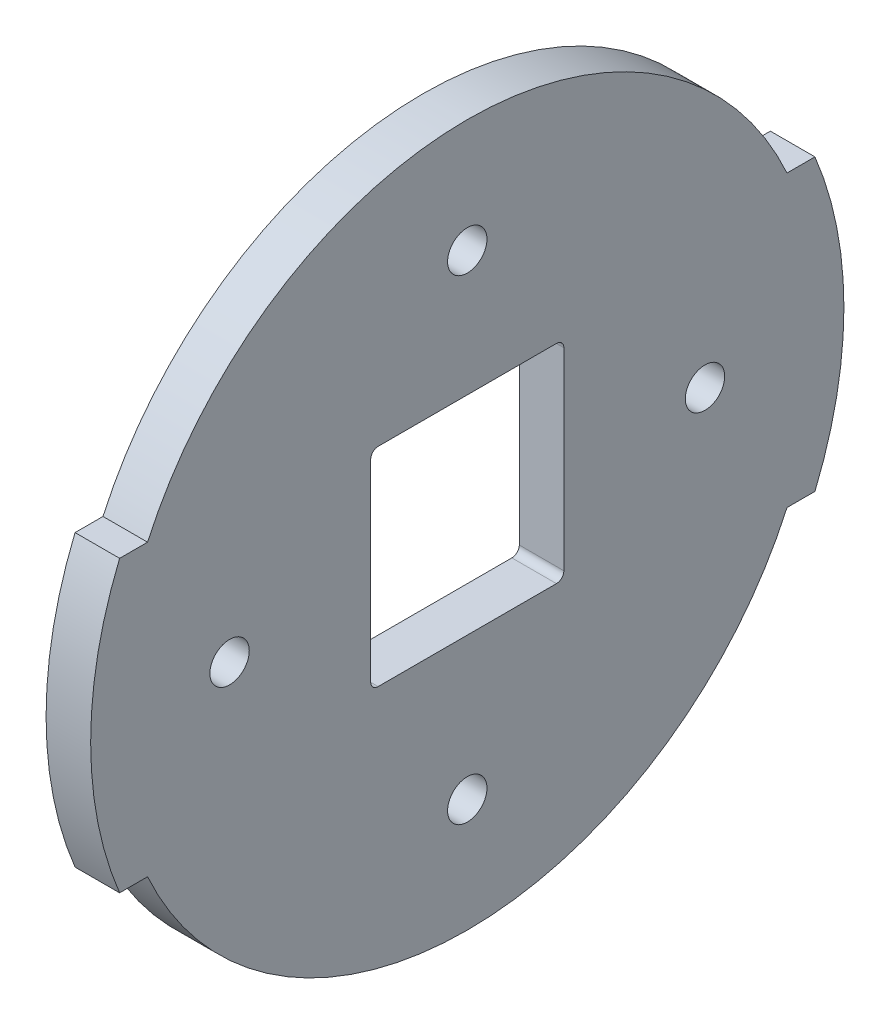
ISO-10303-21;
HEADER;
FILE_DESCRIPTION(('STEP AP214'),'2;1');
FILE_NAME('part.step','',(''),(''),'','','');
FILE_SCHEMA(('AUTOMOTIVE_DESIGN { 1 0 10303 214 1 1 1 1 }'));
ENDSEC;
DATA;
#1=APPLICATION_CONTEXT('core data for automotive mechanical design processes');
#2=APPLICATION_PROTOCOL_DEFINITION('international standard','automotive_design',2000,#1);
#3=PRODUCT_CONTEXT('',#1,'mechanical');
#4=PRODUCT('Part','Part','',(#3));
#5=PRODUCT_RELATED_PRODUCT_CATEGORY('part','',(#4));
#6=PRODUCT_DEFINITION_FORMATION('','',#4);
#7=PRODUCT_DEFINITION_CONTEXT('part definition',#1,'design');
#8=PRODUCT_DEFINITION('design','',#6,#7);
#9=PRODUCT_DEFINITION_SHAPE('','',#8);
#10=(LENGTH_UNIT() NAMED_UNIT(*) SI_UNIT(.MILLI.,.METRE.));
#11=(NAMED_UNIT(*) PLANE_ANGLE_UNIT() SI_UNIT($,.RADIAN.));
#12=(NAMED_UNIT(*) SI_UNIT($,.STERADIAN.) SOLID_ANGLE_UNIT());
#13=UNCERTAINTY_MEASURE_WITH_UNIT(LENGTH_MEASURE(1.E-05),#10,'distance_accuracy_value','');
#14=(GEOMETRIC_REPRESENTATION_CONTEXT(3) GLOBAL_UNCERTAINTY_ASSIGNED_CONTEXT((#13)) GLOBAL_UNIT_ASSIGNED_CONTEXT((#10,
#11,#12)) REPRESENTATION_CONTEXT('',''));
#15=CARTESIAN_POINT('',(0.,0.,0.));
#16=DIRECTION('',(0.,0.,1.));
#17=DIRECTION('',(1.,0.,0.));
#18=AXIS2_PLACEMENT_3D('',#15,#16,#17);
#19=CARTESIAN_POINT('',(6.,0.,0.));
#20=DIRECTION('',(1.,0.,0.));
#21=DIRECTION('',(0.,0.,-1.));
#22=AXIS2_PLACEMENT_3D('',#19,#20,#21);
#23=PLANE('',#22);
#24=CARTESIAN_POINT('',(6.,0.,-32.));
#25=DIRECTION('',(1.,0.,0.));
#26=DIRECTION('',(0.,0.,-1.));
#27=AXIS2_PLACEMENT_3D('',#24,#25,#26);
#28=CIRCLE('',#27,2.64999999999999);
#29=CARTESIAN_POINT('',(6.,0.,-34.65));
#30=VERTEX_POINT('',#29);
#31=EDGE_CURVE('E306',#30,#30,#28,.T.);
#32=ORIENTED_EDGE('',*,*,#31,.F.);
#33=EDGE_LOOP('',(#32));
#34=FACE_BOUND('',#33,.T.);
#35=CARTESIAN_POINT('',(6.,32.,1.1172740284298E-13));
#36=DIRECTION('',(1.,0.,0.));
#37=DIRECTION('',(0.,0.,-1.));
#38=AXIS2_PLACEMENT_3D('',#35,#36,#37);
#39=CIRCLE('',#38,2.64999999999999);
#40=CARTESIAN_POINT('',(6.,32.,-2.64999999999987));
#41=VERTEX_POINT('',#40);
#42=EDGE_CURVE('E300',#41,#41,#39,.T.);
#43=ORIENTED_EDGE('',*,*,#42,.F.);
#44=EDGE_LOOP('',(#43));
#45=FACE_BOUND('',#44,.T.);
#46=CARTESIAN_POINT('',(6.,-2.23454805685961E-13,32.));
#47=DIRECTION('',(1.,0.,0.));
#48=DIRECTION('',(0.,0.,-1.));
#49=AXIS2_PLACEMENT_3D('',#46,#47,#48);
#50=CIRCLE('',#49,2.64999999999999);
#51=CARTESIAN_POINT('',(6.,-2.23454805685961E-13,29.35));
#52=VERTEX_POINT('',#51);
#53=EDGE_CURVE('E294',#52,#52,#50,.T.);
#54=ORIENTED_EDGE('',*,*,#53,.F.);
#55=EDGE_LOOP('',(#54));
#56=FACE_BOUND('',#55,.T.);
#57=CARTESIAN_POINT('',(6.,-32.,-3.35182208528941E-13));
#58=DIRECTION('',(1.,0.,0.));
#59=DIRECTION('',(0.,0.,-1.));
#60=AXIS2_PLACEMENT_3D('',#57,#58,#59);
#61=CIRCLE('',#60,2.64999999999999);
#62=CARTESIAN_POINT('',(6.,-32.,-2.65000000000032));
#63=VERTEX_POINT('',#62);
#64=EDGE_CURVE('E287',#63,#63,#61,.T.);
#65=ORIENTED_EDGE('',*,*,#64,.F.);
#66=EDGE_LOOP('',(#65));
#67=FACE_BOUND('',#66,.T.);
#68=CARTESIAN_POINT('',(6.,0.,0.));
#69=DIRECTION('',(1.,0.,0.));
#70=DIRECTION('',(0.,0.,-1.));
#71=AXIS2_PLACEMENT_3D('',#68,#69,#70);
#72=CIRCLE('',#71,50.7);
#73=CARTESIAN_POINT('',(6.,19.5,46.8));
#74=VERTEX_POINT('',#73);
#75=CARTESIAN_POINT('',(6.,-19.5,46.8));
#76=VERTEX_POINT('',#75);
#77=EDGE_CURVE('E196',#74,#76,#72,.T.);
#78=ORIENTED_EDGE('',*,*,#77,.T.);
#79=DIRECTION('',(0.,0.,-1.));
#80=VECTOR('',#79,1.);
#81=CARTESIAN_POINT('',(6.,-19.5,46.8));
#82=LINE('',#81,#80);
#83=CARTESIAN_POINT('',(6.,-19.5,43.0385002062107));
#84=VERTEX_POINT('',#83);
#85=EDGE_CURVE('E199',#76,#84,#82,.T.);
#86=ORIENTED_EDGE('',*,*,#85,.T.);
#87=CARTESIAN_POINT('',(6.,0.,0.));
#88=DIRECTION('',(1.,0.,0.));
#89=DIRECTION('',(0.,0.,-1.));
#90=AXIS2_PLACEMENT_3D('',#87,#88,#89);
#91=CIRCLE('',#90,47.25);
#92=CARTESIAN_POINT('',(6.,-19.5,-43.0385002062107));
#93=VERTEX_POINT('',#92);
#94=EDGE_CURVE('E202',#84,#93,#91,.T.);
#95=ORIENTED_EDGE('',*,*,#94,.T.);
#96=DIRECTION('',(0.,0.,-1.));
#97=VECTOR('',#96,1.);
#98=CARTESIAN_POINT('',(6.,-19.5,-46.8));
#99=LINE('',#98,#97);
#100=CARTESIAN_POINT('',(6.,-19.5,-46.8));
#101=VERTEX_POINT('',#100);
#102=EDGE_CURVE('E204',#93,#101,#99,.T.);
#103=ORIENTED_EDGE('',*,*,#102,.T.);
#104=CARTESIAN_POINT('',(6.,0.,0.));
#105=DIRECTION('',(1.,0.,0.));
#106=DIRECTION('',(0.,0.,-1.));
#107=AXIS2_PLACEMENT_3D('',#104,#105,#106);
#108=CIRCLE('',#107,50.7);
#109=CARTESIAN_POINT('',(6.,19.5,-46.8));
#110=VERTEX_POINT('',#109);
#111=EDGE_CURVE('E206',#101,#110,#108,.T.);
#112=ORIENTED_EDGE('',*,*,#111,.T.);
#113=DIRECTION('',(0.,0.,1.));
#114=VECTOR('',#113,1.);
#115=CARTESIAN_POINT('',(6.,19.5,-46.8));
#116=LINE('',#115,#114);
#117=CARTESIAN_POINT('',(6.,19.5,-43.0385002062107));
#118=VERTEX_POINT('',#117);
#119=EDGE_CURVE('E208',#110,#118,#116,.T.);
#120=ORIENTED_EDGE('',*,*,#119,.T.);
#121=CARTESIAN_POINT('',(6.,0.,0.));
#122=DIRECTION('',(1.,0.,0.));
#123=DIRECTION('',(0.,0.,-1.));
#124=AXIS2_PLACEMENT_3D('',#121,#122,#123);
#125=CIRCLE('',#124,47.25);
#126=CARTESIAN_POINT('',(6.,19.5,43.0385002062107));
#127=VERTEX_POINT('',#126);
#128=EDGE_CURVE('E210',#118,#127,#125,.T.);
#129=ORIENTED_EDGE('',*,*,#128,.T.);
#130=DIRECTION('',(0.,0.,1.));
#131=VECTOR('',#130,1.);
#132=CARTESIAN_POINT('',(6.,19.5,46.8));
#133=LINE('',#132,#131);
#134=EDGE_CURVE('E212',#127,#74,#133,.T.);
#135=ORIENTED_EDGE('',*,*,#134,.T.);
#136=EDGE_LOOP('',(#78,#86,#95,#103,#112,#120,#129,#135));
#137=FACE_BOUND('',#136,.T.);
#138=CARTESIAN_POINT('',(6.,-11.85,12.));
#139=DIRECTION('',(1.,0.,0.));
#140=DIRECTION('',(0.,0.,-1.));
#141=AXIS2_PLACEMENT_3D('',#138,#139,#140);
#142=CIRCLE('',#141,1.);
#143=CARTESIAN_POINT('',(6.,-11.85,13.));
#144=VERTEX_POINT('',#143);
#145=CARTESIAN_POINT('',(6.,-12.85,12.));
#146=VERTEX_POINT('',#145);
#147=EDGE_CURVE('E160',#144,#146,#142,.T.);
#148=ORIENTED_EDGE('',*,*,#147,.F.);
#149=DIRECTION('',(0.,1.,0.));
#150=VECTOR('',#149,1.);
#151=CARTESIAN_POINT('',(6.,0.,13.));
#152=LINE('',#151,#150);
#153=CARTESIAN_POINT('',(6.,14.15,13.));
#154=VERTEX_POINT('',#153);
#155=EDGE_CURVE('E51',#144,#154,#152,.T.);
#156=ORIENTED_EDGE('',*,*,#155,.T.);
#157=CARTESIAN_POINT('',(6.,14.15,12.));
#158=DIRECTION('',(1.,0.,0.));
#159=DIRECTION('',(0.,0.,-1.));
#160=AXIS2_PLACEMENT_3D('',#157,#158,#159);
#161=CIRCLE('',#160,1.);
#162=CARTESIAN_POINT('',(6.,15.15,12.));
#163=VERTEX_POINT('',#162);
#164=EDGE_CURVE('E180',#154,#163,#161,.F.);
#165=ORIENTED_EDGE('',*,*,#164,.T.);
#166=DIRECTION('',(0.,0.,1.));
#167=VECTOR('',#166,1.);
#168=CARTESIAN_POINT('',(6.,15.15,0.));
#169=LINE('',#168,#167);
#170=CARTESIAN_POINT('',(6.,15.15,-12.));
#171=VERTEX_POINT('',#170);
#172=EDGE_CURVE('E177',#171,#163,#169,.T.);
#173=ORIENTED_EDGE('',*,*,#172,.F.);
#174=CARTESIAN_POINT('',(6.,14.15,-12.));
#175=DIRECTION('',(1.,0.,0.));
#176=DIRECTION('',(0.,0.,-1.));
#177=AXIS2_PLACEMENT_3D('',#174,#175,#176);
#178=CIRCLE('',#177,1.);
#179=CARTESIAN_POINT('',(6.,14.15,-13.));
#180=VERTEX_POINT('',#179);
#181=EDGE_CURVE('E174',#180,#171,#178,.T.);
#182=ORIENTED_EDGE('',*,*,#181,.F.);
#183=DIRECTION('',(0.,1.,0.));
#184=VECTOR('',#183,1.);
#185=CARTESIAN_POINT('',(6.,0.,-13.));
#186=LINE('',#185,#184);
#187=CARTESIAN_POINT('',(6.,-11.85,-13.));
#188=VERTEX_POINT('',#187);
#189=EDGE_CURVE('E168',#188,#180,#186,.T.);
#190=ORIENTED_EDGE('',*,*,#189,.F.);
#191=CARTESIAN_POINT('',(6.,-11.85,-12.));
#192=DIRECTION('',(1.,0.,0.));
#193=DIRECTION('',(0.,0.,-1.));
#194=AXIS2_PLACEMENT_3D('',#191,#192,#193);
#195=CIRCLE('',#194,1.);
#196=CARTESIAN_POINT('',(6.,-12.85,-12.));
#197=VERTEX_POINT('',#196);
#198=EDGE_CURVE('E166',#188,#197,#195,.F.);
#199=ORIENTED_EDGE('',*,*,#198,.T.);
#200=DIRECTION('',(0.,0.,1.));
#201=VECTOR('',#200,1.);
#202=CARTESIAN_POINT('',(6.,-12.85,0.));
#203=LINE('',#202,#201);
#204=EDGE_CURVE('E151',#197,#146,#203,.T.);
#205=ORIENTED_EDGE('',*,*,#204,.T.);
#206=EDGE_LOOP('',(#148,#156,#165,#173,#182,#190,#199,#205));
#207=FACE_BOUND('',#206,.T.);
#208=ADVANCED_FACE('F36',(#34,#45,#56,#67,#137,#207),#23,.T.);
#209=CARTESIAN_POINT('',(0.,0.,0.));
#210=DIRECTION('',(1.,0.,0.));
#211=DIRECTION('',(0.,0.,-1.));
#212=AXIS2_PLACEMENT_3D('',#209,#210,#211);
#213=PLANE('',#212);
#214=CARTESIAN_POINT('',(0.,0.,-32.));
#215=DIRECTION('',(-1.,0.,0.));
#216=DIRECTION('',(0.,0.,1.));
#217=AXIS2_PLACEMENT_3D('',#214,#215,#216);
#218=CIRCLE('',#217,2.64999999999999);
#219=CARTESIAN_POINT('',(0.,0.,-29.35));
#220=VERTEX_POINT('',#219);
#221=EDGE_CURVE('E309',#220,#220,#218,.T.);
#222=ORIENTED_EDGE('',*,*,#221,.F.);
#223=EDGE_LOOP('',(#222));
#224=FACE_BOUND('',#223,.T.);
#225=CARTESIAN_POINT('',(0.,32.,1.1172740284298E-13));
#226=DIRECTION('',(-1.,0.,0.));
#227=DIRECTION('',(0.,0.,1.));
#228=AXIS2_PLACEMENT_3D('',#225,#226,#227);
#229=CIRCLE('',#228,2.64999999999999);
#230=CARTESIAN_POINT('',(0.,32.,2.6500000000001));
#231=VERTEX_POINT('',#230);
#232=EDGE_CURVE('E303',#231,#231,#229,.T.);
#233=ORIENTED_EDGE('',*,*,#232,.F.);
#234=EDGE_LOOP('',(#233));
#235=FACE_BOUND('',#234,.T.);
#236=CARTESIAN_POINT('',(0.,-2.23454805685961E-13,32.));
#237=DIRECTION('',(-1.,0.,0.));
#238=DIRECTION('',(0.,0.,1.));
#239=AXIS2_PLACEMENT_3D('',#236,#237,#238);
#240=CIRCLE('',#239,2.64999999999999);
#241=CARTESIAN_POINT('',(0.,-2.23454805685961E-13,34.65));
#242=VERTEX_POINT('',#241);
#243=EDGE_CURVE('E297',#242,#242,#240,.T.);
#244=ORIENTED_EDGE('',*,*,#243,.F.);
#245=EDGE_LOOP('',(#244));
#246=FACE_BOUND('',#245,.T.);
#247=CARTESIAN_POINT('',(0.,-32.,-3.35182208528941E-13));
#248=DIRECTION('',(-1.,0.,0.));
#249=DIRECTION('',(0.,0.,1.));
#250=AXIS2_PLACEMENT_3D('',#247,#248,#249);
#251=CIRCLE('',#250,2.64999999999999);
#252=CARTESIAN_POINT('',(0.,-32.,2.64999999999965));
#253=VERTEX_POINT('',#252);
#254=EDGE_CURVE('E289',#253,#253,#251,.T.);
#255=ORIENTED_EDGE('',*,*,#254,.F.);
#256=EDGE_LOOP('',(#255));
#257=FACE_BOUND('',#256,.T.);
#258=CARTESIAN_POINT('',(0.,0.,0.));
#259=DIRECTION('',(1.,0.,0.));
#260=DIRECTION('',(0.,0.,-1.));
#261=AXIS2_PLACEMENT_3D('',#258,#259,#260);
#262=CIRCLE('',#261,50.7);
#263=CARTESIAN_POINT('',(0.,19.5,46.8));
#264=VERTEX_POINT('',#263);
#265=CARTESIAN_POINT('',(0.,-19.5,46.8));
#266=VERTEX_POINT('',#265);
#267=EDGE_CURVE('E185',#264,#266,#262,.T.);
#268=ORIENTED_EDGE('',*,*,#267,.F.);
#269=DIRECTION('',(0.,0.,1.));
#270=VECTOR('',#269,1.);
#271=CARTESIAN_POINT('',(0.,19.5,46.8));
#272=LINE('',#271,#270);
#273=CARTESIAN_POINT('',(0.,19.5,43.0385002062107));
#274=VERTEX_POINT('',#273);
#275=EDGE_CURVE('E200',#274,#264,#272,.T.);
#276=ORIENTED_EDGE('',*,*,#275,.F.);
#277=CARTESIAN_POINT('',(0.,0.,0.));
#278=DIRECTION('',(1.,0.,0.));
#279=DIRECTION('',(0.,0.,-1.));
#280=AXIS2_PLACEMENT_3D('',#277,#278,#279);
#281=CIRCLE('',#280,47.25);
#282=CARTESIAN_POINT('',(0.,19.5,-43.0385002062107));
#283=VERTEX_POINT('',#282);
#284=EDGE_CURVE('E227',#283,#274,#281,.T.);
#285=ORIENTED_EDGE('',*,*,#284,.F.);
#286=DIRECTION('',(0.,0.,1.));
#287=VECTOR('',#286,1.);
#288=CARTESIAN_POINT('',(0.,19.5,-46.8));
#289=LINE('',#288,#287);
#290=CARTESIAN_POINT('',(0.,19.5,-46.8));
#291=VERTEX_POINT('',#290);
#292=EDGE_CURVE('E225',#291,#283,#289,.T.);
#293=ORIENTED_EDGE('',*,*,#292,.F.);
#294=CARTESIAN_POINT('',(0.,0.,0.));
#295=DIRECTION('',(1.,0.,0.));
#296=DIRECTION('',(0.,0.,-1.));
#297=AXIS2_PLACEMENT_3D('',#294,#295,#296);
#298=CIRCLE('',#297,50.7);
#299=CARTESIAN_POINT('',(0.,-19.5,-46.8));
#300=VERTEX_POINT('',#299);
#301=EDGE_CURVE('E223',#300,#291,#298,.T.);
#302=ORIENTED_EDGE('',*,*,#301,.F.);
#303=DIRECTION('',(0.,0.,-1.));
#304=VECTOR('',#303,1.);
#305=CARTESIAN_POINT('',(0.,-19.5,-46.8));
#306=LINE('',#305,#304);
#307=CARTESIAN_POINT('',(0.,-19.5,-43.0385002062107));
#308=VERTEX_POINT('',#307);
#309=EDGE_CURVE('E221',#308,#300,#306,.T.);
#310=ORIENTED_EDGE('',*,*,#309,.F.);
#311=CARTESIAN_POINT('',(0.,0.,0.));
#312=DIRECTION('',(1.,0.,0.));
#313=DIRECTION('',(0.,0.,-1.));
#314=AXIS2_PLACEMENT_3D('',#311,#312,#313);
#315=CIRCLE('',#314,47.25);
#316=CARTESIAN_POINT('',(0.,-19.5,43.0385002062107));
#317=VERTEX_POINT('',#316);
#318=EDGE_CURVE('E219',#317,#308,#315,.T.);
#319=ORIENTED_EDGE('',*,*,#318,.F.);
#320=DIRECTION('',(0.,0.,-1.));
#321=VECTOR('',#320,1.);
#322=CARTESIAN_POINT('',(0.,-19.5,46.8));
#323=LINE('',#322,#321);
#324=EDGE_CURVE('E217',#266,#317,#323,.T.);
#325=ORIENTED_EDGE('',*,*,#324,.F.);
#326=EDGE_LOOP('',(#268,#276,#285,#293,#302,#310,#319,#325));
#327=FACE_BOUND('',#326,.T.);
#328=DIRECTION('',(0.,1.,0.));
#329=VECTOR('',#328,1.);
#330=CARTESIAN_POINT('',(0.,0.,13.));
#331=LINE('',#330,#329);
#332=CARTESIAN_POINT('',(0.,-11.85,13.));
#333=VERTEX_POINT('',#332);
#334=CARTESIAN_POINT('',(0.,14.15,13.));
#335=VERTEX_POINT('',#334);
#336=EDGE_CURVE('E11',#333,#335,#331,.T.);
#337=ORIENTED_EDGE('',*,*,#336,.F.);
#338=CARTESIAN_POINT('',(0.,-11.85,12.));
#339=DIRECTION('',(1.,0.,0.));
#340=DIRECTION('',(0.,0.,-1.));
#341=AXIS2_PLACEMENT_3D('',#338,#339,#340);
#342=CIRCLE('',#341,1.);
#343=CARTESIAN_POINT('',(0.,-12.85,12.));
#344=VERTEX_POINT('',#343);
#345=EDGE_CURVE('E253',#333,#344,#342,.T.);
#346=ORIENTED_EDGE('',*,*,#345,.T.);
#347=DIRECTION('',(0.,0.,1.));
#348=VECTOR('',#347,1.);
#349=CARTESIAN_POINT('',(0.,-12.85,0.));
#350=LINE('',#349,#348);
#351=CARTESIAN_POINT('',(0.,-12.85,-12.));
#352=VERTEX_POINT('',#351);
#353=EDGE_CURVE('E154',#352,#344,#350,.T.);
#354=ORIENTED_EDGE('',*,*,#353,.F.);
#355=CARTESIAN_POINT('',(0.,-11.85,-12.));
#356=DIRECTION('',(1.,0.,0.));
#357=DIRECTION('',(0.,0.,-1.));
#358=AXIS2_PLACEMENT_3D('',#355,#356,#357);
#359=CIRCLE('',#358,1.);
#360=CARTESIAN_POINT('',(0.,-11.85,-13.));
#361=VERTEX_POINT('',#360);
#362=EDGE_CURVE('E256',#361,#352,#359,.F.);
#363=ORIENTED_EDGE('',*,*,#362,.F.);
#364=DIRECTION('',(0.,1.,0.));
#365=VECTOR('',#364,1.);
#366=CARTESIAN_POINT('',(0.,0.,-13.));
#367=LINE('',#366,#365);
#368=CARTESIAN_POINT('',(0.,14.15,-13.));
#369=VERTEX_POINT('',#368);
#370=EDGE_CURVE('E258',#361,#369,#367,.T.);
#371=ORIENTED_EDGE('',*,*,#370,.T.);
#372=CARTESIAN_POINT('',(0.,14.15,-12.));
#373=DIRECTION('',(1.,0.,0.));
#374=DIRECTION('',(0.,0.,-1.));
#375=AXIS2_PLACEMENT_3D('',#372,#373,#374);
#376=CIRCLE('',#375,1.);
#377=CARTESIAN_POINT('',(0.,15.15,-12.));
#378=VERTEX_POINT('',#377);
#379=EDGE_CURVE('E261',#369,#378,#376,.T.);
#380=ORIENTED_EDGE('',*,*,#379,.T.);
#381=DIRECTION('',(0.,0.,1.));
#382=VECTOR('',#381,1.);
#383=CARTESIAN_POINT('',(0.,15.15,0.));
#384=LINE('',#383,#382);
#385=CARTESIAN_POINT('',(0.,15.15,12.));
#386=VERTEX_POINT('',#385);
#387=EDGE_CURVE('E264',#378,#386,#384,.T.);
#388=ORIENTED_EDGE('',*,*,#387,.T.);
#389=CARTESIAN_POINT('',(0.,14.15,12.));
#390=DIRECTION('',(1.,0.,0.));
#391=DIRECTION('',(0.,0.,-1.));
#392=AXIS2_PLACEMENT_3D('',#389,#390,#391);
#393=CIRCLE('',#392,1.);
#394=EDGE_CURVE('E44',#335,#386,#393,.F.);
#395=ORIENTED_EDGE('',*,*,#394,.F.);
#396=EDGE_LOOP('',(#337,#346,#354,#363,#371,#380,#388,#395));
#397=FACE_BOUND('',#396,.T.);
#398=ADVANCED_FACE('F278',(#224,#235,#246,#257,#327,#397),#213,.F.);
#399=CARTESIAN_POINT('',(6.,0.,0.));
#400=DIRECTION('',(-1.,0.,0.));
#401=DIRECTION('',(0.,0.,1.));
#402=AXIS2_PLACEMENT_3D('',#399,#400,#401);
#403=CYLINDRICAL_SURFACE('',#402,50.7);
#404=ORIENTED_EDGE('',*,*,#267,.T.);
#405=DIRECTION('',(-1.,0.,0.));
#406=VECTOR('',#405,1.);
#407=CARTESIAN_POINT('',(6.,-19.5,46.8));
#408=LINE('',#407,#406);
#409=EDGE_CURVE('E250',#76,#266,#408,.T.);
#410=ORIENTED_EDGE('',*,*,#409,.F.);
#411=ORIENTED_EDGE('',*,*,#77,.F.);
#412=DIRECTION('',(-1.,0.,0.));
#413=VECTOR('',#412,1.);
#414=CARTESIAN_POINT('',(6.,19.5,46.8));
#415=LINE('',#414,#413);
#416=EDGE_CURVE('E214',#74,#264,#415,.T.);
#417=ORIENTED_EDGE('',*,*,#416,.T.);
#418=EDGE_LOOP('',(#404,#410,#411,#417));
#419=FACE_BOUND('',#418,.T.);
#420=ADVANCED_FACE('F38',(#419),#403,.T.);
#421=CARTESIAN_POINT('',(6.,-19.5,46.8));
#422=DIRECTION('',(0.,1.,0.));
#423=DIRECTION('',(0.,0.,1.));
#424=AXIS2_PLACEMENT_3D('',#421,#422,#423);
#425=PLANE('',#424);
#426=ORIENTED_EDGE('',*,*,#324,.T.);
#427=DIRECTION('',(-1.,0.,0.));
#428=VECTOR('',#427,1.);
#429=CARTESIAN_POINT('',(6.,-19.5,43.0385002062107));
#430=LINE('',#429,#428);
#431=EDGE_CURVE('E247',#84,#317,#430,.T.);
#432=ORIENTED_EDGE('',*,*,#431,.F.);
#433=ORIENTED_EDGE('',*,*,#85,.F.);
#434=ORIENTED_EDGE('',*,*,#409,.T.);
#435=EDGE_LOOP('',(#426,#432,#433,#434));
#436=FACE_BOUND('',#435,.T.);
#437=ADVANCED_FACE('F360',(#436),#425,.F.);
#438=CARTESIAN_POINT('',(6.,0.,0.));
#439=DIRECTION('',(-1.,0.,0.));
#440=DIRECTION('',(0.,0.,1.));
#441=AXIS2_PLACEMENT_3D('',#438,#439,#440);
#442=CYLINDRICAL_SURFACE('',#441,47.25);
#443=ORIENTED_EDGE('',*,*,#318,.T.);
#444=DIRECTION('',(-1.,0.,0.));
#445=VECTOR('',#444,1.);
#446=CARTESIAN_POINT('',(6.,-19.5,-43.0385002062107));
#447=LINE('',#446,#445);
#448=EDGE_CURVE('E244',#93,#308,#447,.T.);
#449=ORIENTED_EDGE('',*,*,#448,.F.);
#450=ORIENTED_EDGE('',*,*,#94,.F.);
#451=ORIENTED_EDGE('',*,*,#431,.T.);
#452=EDGE_LOOP('',(#443,#449,#450,#451));
#453=FACE_BOUND('',#452,.T.);
#454=ADVANCED_FACE('F356',(#453),#442,.T.);
#455=CARTESIAN_POINT('',(6.,-19.5,-46.8));
#456=DIRECTION('',(0.,1.,0.));
#457=DIRECTION('',(0.,0.,1.));
#458=AXIS2_PLACEMENT_3D('',#455,#456,#457);
#459=PLANE('',#458);
#460=ORIENTED_EDGE('',*,*,#309,.T.);
#461=DIRECTION('',(-1.,0.,0.));
#462=VECTOR('',#461,1.);
#463=CARTESIAN_POINT('',(6.,-19.5,-46.8));
#464=LINE('',#463,#462);
#465=EDGE_CURVE('E241',#101,#300,#464,.T.);
#466=ORIENTED_EDGE('',*,*,#465,.F.);
#467=ORIENTED_EDGE('',*,*,#102,.F.);
#468=ORIENTED_EDGE('',*,*,#448,.T.);
#469=EDGE_LOOP('',(#460,#466,#467,#468));
#470=FACE_BOUND('',#469,.T.);
#471=ADVANCED_FACE('F353',(#470),#459,.F.);
#472=CARTESIAN_POINT('',(6.,0.,0.));
#473=DIRECTION('',(-1.,0.,0.));
#474=DIRECTION('',(0.,0.,1.));
#475=AXIS2_PLACEMENT_3D('',#472,#473,#474);
#476=CYLINDRICAL_SURFACE('',#475,50.7);
#477=ORIENTED_EDGE('',*,*,#301,.T.);
#478=DIRECTION('',(-1.,0.,0.));
#479=VECTOR('',#478,1.);
#480=CARTESIAN_POINT('',(6.,19.5,-46.8));
#481=LINE('',#480,#479);
#482=EDGE_CURVE('E238',#110,#291,#481,.T.);
#483=ORIENTED_EDGE('',*,*,#482,.F.);
#484=ORIENTED_EDGE('',*,*,#111,.F.);
#485=ORIENTED_EDGE('',*,*,#465,.T.);
#486=EDGE_LOOP('',(#477,#483,#484,#485));
#487=FACE_BOUND('',#486,.T.);
#488=ADVANCED_FACE('F349',(#487),#476,.T.);
#489=CARTESIAN_POINT('',(6.,19.5,-46.8));
#490=DIRECTION('',(0.,-1.,0.));
#491=DIRECTION('',(0.,0.,-1.));
#492=AXIS2_PLACEMENT_3D('',#489,#490,#491);
#493=PLANE('',#492);
#494=ORIENTED_EDGE('',*,*,#292,.T.);
#495=DIRECTION('',(-1.,0.,0.));
#496=VECTOR('',#495,1.);
#497=CARTESIAN_POINT('',(6.,19.5,-43.0385002062107));
#498=LINE('',#497,#496);
#499=EDGE_CURVE('E235',#118,#283,#498,.T.);
#500=ORIENTED_EDGE('',*,*,#499,.F.);
#501=ORIENTED_EDGE('',*,*,#119,.F.);
#502=ORIENTED_EDGE('',*,*,#482,.T.);
#503=EDGE_LOOP('',(#494,#500,#501,#502));
#504=FACE_BOUND('',#503,.T.);
#505=ADVANCED_FACE('F344',(#504),#493,.F.);
#506=CARTESIAN_POINT('',(6.,0.,0.));
#507=DIRECTION('',(-1.,0.,0.));
#508=DIRECTION('',(0.,0.,1.));
#509=AXIS2_PLACEMENT_3D('',#506,#507,#508);
#510=CYLINDRICAL_SURFACE('',#509,47.25);
#511=ORIENTED_EDGE('',*,*,#284,.T.);
#512=DIRECTION('',(-1.,0.,0.));
#513=VECTOR('',#512,1.);
#514=CARTESIAN_POINT('',(6.,19.5,43.0385002062107));
#515=LINE('',#514,#513);
#516=EDGE_CURVE('E232',#127,#274,#515,.T.);
#517=ORIENTED_EDGE('',*,*,#516,.F.);
#518=ORIENTED_EDGE('',*,*,#128,.F.);
#519=ORIENTED_EDGE('',*,*,#499,.T.);
#520=EDGE_LOOP('',(#511,#517,#518,#519));
#521=FACE_BOUND('',#520,.T.);
#522=ADVANCED_FACE('F338',(#521),#510,.T.);
#523=CARTESIAN_POINT('',(6.,19.5,46.8));
#524=DIRECTION('',(0.,-1.,0.));
#525=DIRECTION('',(0.,0.,-1.));
#526=AXIS2_PLACEMENT_3D('',#523,#524,#525);
#527=PLANE('',#526);
#528=ORIENTED_EDGE('',*,*,#275,.T.);
#529=ORIENTED_EDGE('',*,*,#416,.F.);
#530=ORIENTED_EDGE('',*,*,#134,.F.);
#531=ORIENTED_EDGE('',*,*,#516,.T.);
#532=EDGE_LOOP('',(#528,#529,#530,#531));
#533=FACE_BOUND('',#532,.T.);
#534=ADVANCED_FACE('F334',(#533),#527,.F.);
#535=CARTESIAN_POINT('',(-14.,0.,13.));
#536=DIRECTION('',(0.,0.,-1.));
#537=DIRECTION('',(-1.,0.,0.));
#538=AXIS2_PLACEMENT_3D('',#535,#536,#537);
#539=PLANE('',#538);
#540=ORIENTED_EDGE('',*,*,#336,.T.);
#541=DIRECTION('',(1.,0.,0.));
#542=VECTOR('',#541,1.);
#543=CARTESIAN_POINT('',(-14.,14.15,13.));
#544=LINE('',#543,#542);
#545=EDGE_CURVE('E183',#335,#154,#544,.T.);
#546=ORIENTED_EDGE('',*,*,#545,.T.);
#547=ORIENTED_EDGE('',*,*,#155,.F.);
#548=DIRECTION('',(1.,0.,0.));
#549=VECTOR('',#548,1.);
#550=CARTESIAN_POINT('',(-14.,-11.85,13.));
#551=LINE('',#550,#549);
#552=EDGE_CURVE('E157',#333,#144,#551,.T.);
#553=ORIENTED_EDGE('',*,*,#552,.F.);
#554=EDGE_LOOP('',(#540,#546,#547,#553));
#555=FACE_BOUND('',#554,.T.);
#556=ADVANCED_FACE('F370',(#555),#539,.T.);
#557=CARTESIAN_POINT('',(-14.,14.15,12.));
#558=DIRECTION('',(1.,0.,0.));
#559=DIRECTION('',(0.,0.,-1.));
#560=AXIS2_PLACEMENT_3D('',#557,#558,#559);
#561=CYLINDRICAL_SURFACE('',#560,1.);
#562=ORIENTED_EDGE('',*,*,#394,.T.);
#563=DIRECTION('',(1.,0.,0.));
#564=VECTOR('',#563,1.);
#565=CARTESIAN_POINT('',(-14.,15.15,12.));
#566=LINE('',#565,#564);
#567=EDGE_CURVE('E186',#386,#163,#566,.T.);
#568=ORIENTED_EDGE('',*,*,#567,.T.);
#569=ORIENTED_EDGE('',*,*,#164,.F.);
#570=ORIENTED_EDGE('',*,*,#545,.F.);
#571=EDGE_LOOP('',(#562,#568,#569,#570));
#572=FACE_BOUND('',#571,.T.);
#573=ADVANCED_FACE('F270',(#572),#561,.F.);
#574=CARTESIAN_POINT('',(-14.,15.15,0.));
#575=DIRECTION('',(0.,1.,0.));
#576=DIRECTION('',(0.,0.,1.));
#577=AXIS2_PLACEMENT_3D('',#574,#575,#576);
#578=PLANE('',#577);
#579=DIRECTION('',(1.,0.,0.));
#580=VECTOR('',#579,1.);
#581=CARTESIAN_POINT('',(-14.,15.15,-12.));
#582=LINE('',#581,#580);
#583=EDGE_CURVE('E188',#378,#171,#582,.T.);
#584=ORIENTED_EDGE('',*,*,#583,.T.);
#585=ORIENTED_EDGE('',*,*,#172,.T.);
#586=ORIENTED_EDGE('',*,*,#567,.F.);
#587=ORIENTED_EDGE('',*,*,#387,.F.);
#588=EDGE_LOOP('',(#584,#585,#586,#587));
#589=FACE_BOUND('',#588,.T.);
#590=ADVANCED_FACE('F275',(#589),#578,.F.);
#591=CARTESIAN_POINT('',(-14.,14.15,-12.));
#592=DIRECTION('',(1.,0.,0.));
#593=DIRECTION('',(0.,0.,-1.));
#594=AXIS2_PLACEMENT_3D('',#591,#592,#593);
#595=CYLINDRICAL_SURFACE('',#594,1.);
#596=DIRECTION('',(1.,0.,0.));
#597=VECTOR('',#596,1.);
#598=CARTESIAN_POINT('',(-14.,14.15,-13.));
#599=LINE('',#598,#597);
#600=EDGE_CURVE('E190',#369,#180,#599,.T.);
#601=ORIENTED_EDGE('',*,*,#600,.T.);
#602=ORIENTED_EDGE('',*,*,#181,.T.);
#603=ORIENTED_EDGE('',*,*,#583,.F.);
#604=ORIENTED_EDGE('',*,*,#379,.F.);
#605=EDGE_LOOP('',(#601,#602,#603,#604));
#606=FACE_BOUND('',#605,.T.);
#607=ADVANCED_FACE('F282',(#606),#595,.F.);
#608=CARTESIAN_POINT('',(-14.,0.,-13.));
#609=DIRECTION('',(0.,0.,-1.));
#610=DIRECTION('',(-1.,0.,0.));
#611=AXIS2_PLACEMENT_3D('',#608,#609,#610);
#612=PLANE('',#611);
#613=DIRECTION('',(1.,0.,0.));
#614=VECTOR('',#613,1.);
#615=CARTESIAN_POINT('',(-14.,-11.85,-13.));
#616=LINE('',#615,#614);
#617=EDGE_CURVE('E192',#361,#188,#616,.T.);
#618=ORIENTED_EDGE('',*,*,#617,.T.);
#619=ORIENTED_EDGE('',*,*,#189,.T.);
#620=ORIENTED_EDGE('',*,*,#600,.F.);
#621=ORIENTED_EDGE('',*,*,#370,.F.);
#622=EDGE_LOOP('',(#618,#619,#620,#621));
#623=FACE_BOUND('',#622,.T.);
#624=ADVANCED_FACE('F284',(#623),#612,.F.);
#625=CARTESIAN_POINT('',(-14.,-11.85,-12.));
#626=DIRECTION('',(1.,0.,0.));
#627=DIRECTION('',(0.,0.,-1.));
#628=AXIS2_PLACEMENT_3D('',#625,#626,#627);
#629=CYLINDRICAL_SURFACE('',#628,1.);
#630=ORIENTED_EDGE('',*,*,#362,.T.);
#631=DIRECTION('',(1.,0.,0.));
#632=VECTOR('',#631,1.);
#633=CARTESIAN_POINT('',(-14.,-12.85,-12.));
#634=LINE('',#633,#632);
#635=EDGE_CURVE('E156',#352,#197,#634,.T.);
#636=ORIENTED_EDGE('',*,*,#635,.T.);
#637=ORIENTED_EDGE('',*,*,#198,.F.);
#638=ORIENTED_EDGE('',*,*,#617,.F.);
#639=EDGE_LOOP('',(#630,#636,#637,#638));
#640=FACE_BOUND('',#639,.T.);
#641=ADVANCED_FACE('F451',(#640),#629,.F.);
#642=CARTESIAN_POINT('',(-14.,-12.85,0.));
#643=DIRECTION('',(0.,1.,0.));
#644=DIRECTION('',(0.,0.,1.));
#645=AXIS2_PLACEMENT_3D('',#642,#643,#644);
#646=PLANE('',#645);
#647=ORIENTED_EDGE('',*,*,#353,.T.);
#648=DIRECTION('',(1.,0.,0.));
#649=VECTOR('',#648,1.);
#650=CARTESIAN_POINT('',(-14.,-12.85,12.));
#651=LINE('',#650,#649);
#652=EDGE_CURVE('E59',#344,#146,#651,.T.);
#653=ORIENTED_EDGE('',*,*,#652,.T.);
#654=ORIENTED_EDGE('',*,*,#204,.F.);
#655=ORIENTED_EDGE('',*,*,#635,.F.);
#656=EDGE_LOOP('',(#647,#653,#654,#655));
#657=FACE_BOUND('',#656,.T.);
#658=ADVANCED_FACE('F148',(#657),#646,.T.);
#659=CARTESIAN_POINT('',(-14.,-11.85,12.));
#660=DIRECTION('',(1.,0.,0.));
#661=DIRECTION('',(0.,0.,-1.));
#662=AXIS2_PLACEMENT_3D('',#659,#660,#661);
#663=CYLINDRICAL_SURFACE('',#662,1.);
#664=ORIENTED_EDGE('',*,*,#552,.T.);
#665=ORIENTED_EDGE('',*,*,#147,.T.);
#666=ORIENTED_EDGE('',*,*,#652,.F.);
#667=ORIENTED_EDGE('',*,*,#345,.F.);
#668=EDGE_LOOP('',(#664,#665,#666,#667));
#669=FACE_BOUND('',#668,.T.);
#670=ADVANCED_FACE('F161',(#669),#663,.F.);
#671=CARTESIAN_POINT('',(0.,-32.,-3.35182208528941E-13));
#672=DIRECTION('',(-1.,0.,0.));
#673=DIRECTION('',(0.,0.,1.));
#674=AXIS2_PLACEMENT_3D('',#671,#672,#673);
#675=CYLINDRICAL_SURFACE('',#674,2.64999999999999);
#676=ORIENTED_EDGE('',*,*,#64,.T.);
#677=EDGE_LOOP('',(#676));
#678=FACE_BOUND('',#677,.T.);
#679=ORIENTED_EDGE('',*,*,#254,.T.);
#680=EDGE_LOOP('',(#679));
#681=FACE_BOUND('',#680,.T.);
#682=ADVANCED_FACE('F402',(#678,#681),#675,.F.);
#683=CARTESIAN_POINT('',(0.,-2.23454805685961E-13,32.));
#684=DIRECTION('',(-1.,0.,0.));
#685=DIRECTION('',(0.,0.,1.));
#686=AXIS2_PLACEMENT_3D('',#683,#684,#685);
#687=CYLINDRICAL_SURFACE('',#686,2.64999999999999);
#688=ORIENTED_EDGE('',*,*,#53,.T.);
#689=EDGE_LOOP('',(#688));
#690=FACE_BOUND('',#689,.T.);
#691=ORIENTED_EDGE('',*,*,#243,.T.);
#692=EDGE_LOOP('',(#691));
#693=FACE_BOUND('',#692,.T.);
#694=ADVANCED_FACE('F407',(#690,#693),#687,.F.);
#695=CARTESIAN_POINT('',(0.,32.,1.1172740284298E-13));
#696=DIRECTION('',(-1.,0.,0.));
#697=DIRECTION('',(0.,0.,1.));
#698=AXIS2_PLACEMENT_3D('',#695,#696,#697);
#699=CYLINDRICAL_SURFACE('',#698,2.64999999999999);
#700=ORIENTED_EDGE('',*,*,#42,.T.);
#701=EDGE_LOOP('',(#700));
#702=FACE_BOUND('',#701,.T.);
#703=ORIENTED_EDGE('',*,*,#232,.T.);
#704=EDGE_LOOP('',(#703));
#705=FACE_BOUND('',#704,.T.);
#706=ADVANCED_FACE('F419',(#702,#705),#699,.F.);
#707=CARTESIAN_POINT('',(0.,0.,-32.));
#708=DIRECTION('',(-1.,0.,0.));
#709=DIRECTION('',(0.,0.,1.));
#710=AXIS2_PLACEMENT_3D('',#707,#708,#709);
#711=CYLINDRICAL_SURFACE('',#710,2.64999999999999);
#712=ORIENTED_EDGE('',*,*,#31,.T.);
#713=EDGE_LOOP('',(#712));
#714=FACE_BOUND('',#713,.T.);
#715=ORIENTED_EDGE('',*,*,#221,.T.);
#716=EDGE_LOOP('',(#715));
#717=FACE_BOUND('',#716,.T.);
#718=ADVANCED_FACE('F313',(#714,#717),#711,.F.);
#719=CLOSED_SHELL('',(#208,#398,#420,#437,#454,#471,#488,#505,#522,#534,#556,#573,#590,#607,
#624,#641,#658,#670,#682,#694,#706,#718));
#720=MANIFOLD_SOLID_BREP('B2',#719);
#721=ADVANCED_BREP_SHAPE_REPRESENTATION('',(#18,#720),#14);
#722=SHAPE_DEFINITION_REPRESENTATION(#9,#721);
ENDSEC;
END-ISO-10303-21;
